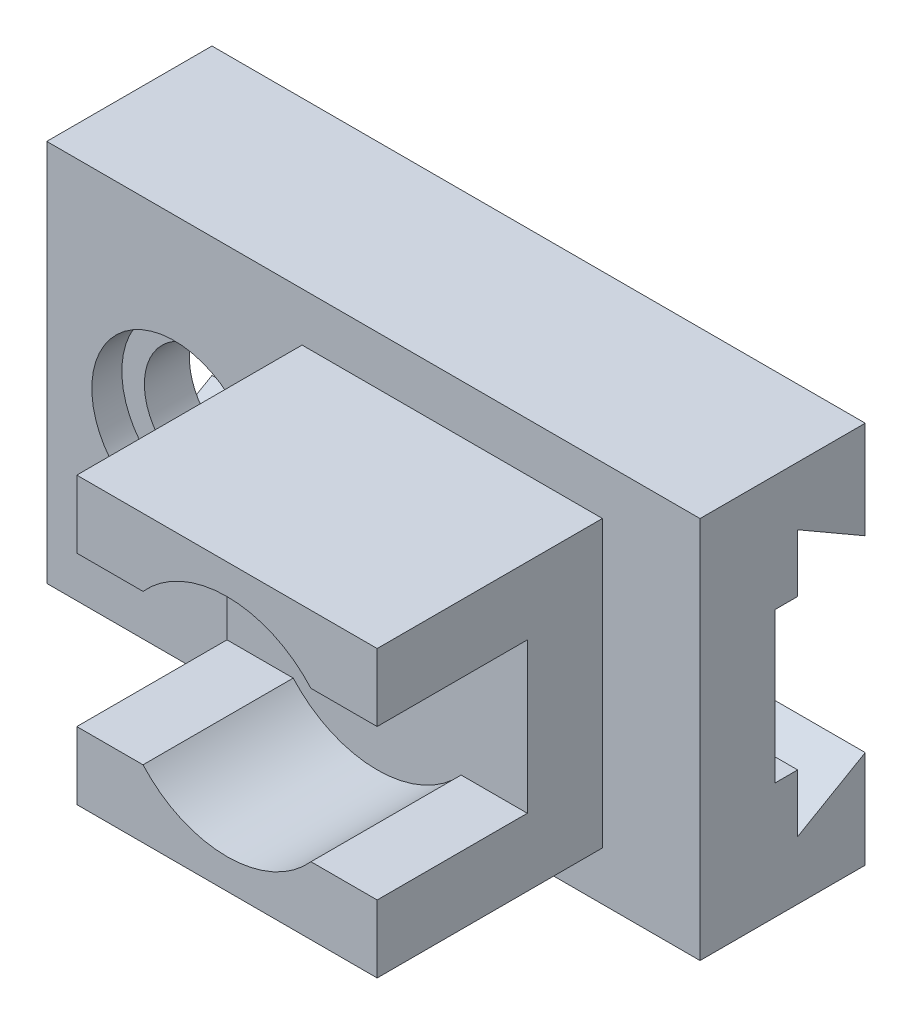
ISO-10303-21;
HEADER;
FILE_DESCRIPTION(('STEP AP214'),'2;1');
FILE_NAME('part.step','',(''),(''),'','','');
FILE_SCHEMA(('AUTOMOTIVE_DESIGN { 1 0 10303 214 1 1 1 1 }'));
ENDSEC;
DATA;
#1=APPLICATION_CONTEXT('core data for automotive mechanical design processes');
#2=APPLICATION_PROTOCOL_DEFINITION('international standard','automotive_design',2000,#1);
#3=PRODUCT_CONTEXT('',#1,'mechanical');
#4=PRODUCT('Part','Part','',(#3));
#5=PRODUCT_RELATED_PRODUCT_CATEGORY('part','',(#4));
#6=PRODUCT_DEFINITION_FORMATION('','',#4);
#7=PRODUCT_DEFINITION_CONTEXT('part definition',#1,'design');
#8=PRODUCT_DEFINITION('design','',#6,#7);
#9=PRODUCT_DEFINITION_SHAPE('','',#8);
#10=(LENGTH_UNIT() NAMED_UNIT(*) SI_UNIT(.MILLI.,.METRE.));
#11=(NAMED_UNIT(*) PLANE_ANGLE_UNIT() SI_UNIT($,.RADIAN.));
#12=(NAMED_UNIT(*) SI_UNIT($,.STERADIAN.) SOLID_ANGLE_UNIT());
#13=UNCERTAINTY_MEASURE_WITH_UNIT(LENGTH_MEASURE(1.E-05),#10,'distance_accuracy_value','');
#14=(GEOMETRIC_REPRESENTATION_CONTEXT(3) GLOBAL_UNCERTAINTY_ASSIGNED_CONTEXT((#13)) GLOBAL_UNIT_ASSIGNED_CONTEXT((#10,
#11,#12)) REPRESENTATION_CONTEXT('',''));
#15=CARTESIAN_POINT('',(0.,0.,0.));
#16=DIRECTION('',(0.,0.,1.));
#17=DIRECTION('',(1.,0.,0.));
#18=AXIS2_PLACEMENT_3D('',#15,#16,#17);
#19=CARTESIAN_POINT('',(0.,0.,-22.));
#20=DIRECTION('',(0.,0.,1.));
#21=DIRECTION('',(1.,0.,0.));
#22=AXIS2_PLACEMENT_3D('',#19,#20,#21);
#23=PLANE('',#22);
#24=DIRECTION('',(0.,-1.,0.));
#25=VECTOR('',#24,1.);
#26=CARTESIAN_POINT('',(-43.5,25.491,-22.));
#27=LINE('',#26,#25);
#28=CARTESIAN_POINT('',(-43.5,-12.5,-22.));
#29=VERTEX_POINT('',#28);
#30=CARTESIAN_POINT('',(-43.5,-25.491,-22.));
#31=VERTEX_POINT('',#30);
#32=EDGE_CURVE('E393',#29,#31,#27,.T.);
#33=ORIENTED_EDGE('',*,*,#32,.F.);
#34=DIRECTION('',(-1.,0.,0.));
#35=VECTOR('',#34,1.);
#36=CARTESIAN_POINT('',(43.5,-12.5,-22.));
#37=LINE('',#36,#35);
#38=CARTESIAN_POINT('',(43.5,-12.5,-22.));
#39=VERTEX_POINT('',#38);
#40=EDGE_CURVE('E294',#39,#29,#37,.T.);
#41=ORIENTED_EDGE('',*,*,#40,.F.);
#42=DIRECTION('',(0.,1.,0.));
#43=VECTOR('',#42,1.);
#44=CARTESIAN_POINT('',(43.5,-25.491,-22.));
#45=LINE('',#44,#43);
#46=CARTESIAN_POINT('',(43.5,-25.491,-22.));
#47=VERTEX_POINT('',#46);
#48=EDGE_CURVE('E402',#47,#39,#45,.T.);
#49=ORIENTED_EDGE('',*,*,#48,.F.);
#50=DIRECTION('',(1.,0.,0.));
#51=VECTOR('',#50,1.);
#52=CARTESIAN_POINT('',(-43.5,-25.491,-22.));
#53=LINE('',#52,#51);
#54=EDGE_CURVE('E398',#31,#47,#53,.T.);
#55=ORIENTED_EDGE('',*,*,#54,.F.);
#56=EDGE_LOOP('',(#33,#41,#49,#55));
#57=FACE_BOUND('',#56,.T.);
#58=ADVANCED_FACE('F71',(#57),#23,.F.);
#59=CARTESIAN_POINT('',(30.5,-19.,30.));
#60=DIRECTION('',(-1.,0.,0.));
#61=DIRECTION('',(0.,0.,1.));
#62=AXIS2_PLACEMENT_3D('',#59,#60,#61);
#63=PLANE('',#62);
#64=DIRECTION('',(0.,0.,1.));
#65=VECTOR('',#64,1.);
#66=CARTESIAN_POINT('',(30.5,9.99999999999999,10.));
#67=LINE('',#66,#65);
#68=CARTESIAN_POINT('',(30.5,9.99999999999999,10.));
#69=VERTEX_POINT('',#68);
#70=CARTESIAN_POINT('',(30.5,9.99999999999999,30.));
#71=VERTEX_POINT('',#70);
#72=EDGE_CURVE('E316',#69,#71,#67,.T.);
#73=ORIENTED_EDGE('',*,*,#72,.F.);
#74=DIRECTION('',(0.,1.,0.));
#75=VECTOR('',#74,1.);
#76=CARTESIAN_POINT('',(30.5,-9.99999999999999,10.));
#77=LINE('',#76,#75);
#78=CARTESIAN_POINT('',(30.5,-9.99999999999999,10.));
#79=VERTEX_POINT('',#78);
#80=EDGE_CURVE('E322',#79,#69,#77,.T.);
#81=ORIENTED_EDGE('',*,*,#80,.F.);
#82=DIRECTION('',(0.,0.,1.));
#83=VECTOR('',#82,1.);
#84=CARTESIAN_POINT('',(30.5,-9.99999999999999,10.));
#85=LINE('',#84,#83);
#86=CARTESIAN_POINT('',(30.5,-9.99999999999999,30.));
#87=VERTEX_POINT('',#86);
#88=EDGE_CURVE('E346',#79,#87,#85,.T.);
#89=ORIENTED_EDGE('',*,*,#88,.T.);
#90=DIRECTION('',(0.,1.,0.));
#91=VECTOR('',#90,1.);
#92=CARTESIAN_POINT('',(30.5,-19.,30.));
#93=LINE('',#92,#91);
#94=CARTESIAN_POINT('',(30.5,-19.,30.));
#95=VERTEX_POINT('',#94);
#96=EDGE_CURVE('E361',#95,#87,#93,.T.);
#97=ORIENTED_EDGE('',*,*,#96,.F.);
#98=DIRECTION('',(0.,0.,-1.));
#99=VECTOR('',#98,1.);
#100=CARTESIAN_POINT('',(30.5,-19.,30.));
#101=LINE('',#100,#99);
#102=CARTESIAN_POINT('',(30.5,-19.,0.));
#103=VERTEX_POINT('',#102);
#104=EDGE_CURVE('E375',#95,#103,#101,.T.);
#105=ORIENTED_EDGE('',*,*,#104,.T.);
#106=DIRECTION('',(0.,1.,0.));
#107=VECTOR('',#106,1.);
#108=CARTESIAN_POINT('',(30.5,-19.,0.));
#109=LINE('',#108,#107);
#110=CARTESIAN_POINT('',(30.5,19.,0.));
#111=VERTEX_POINT('',#110);
#112=EDGE_CURVE('E354',#103,#111,#109,.T.);
#113=ORIENTED_EDGE('',*,*,#112,.T.);
#114=DIRECTION('',(0.,0.,-1.));
#115=VECTOR('',#114,1.);
#116=CARTESIAN_POINT('',(30.5,19.,30.));
#117=LINE('',#116,#115);
#118=CARTESIAN_POINT('',(30.5,19.,30.));
#119=VERTEX_POINT('',#118);
#120=EDGE_CURVE('E364',#119,#111,#117,.T.);
#121=ORIENTED_EDGE('',*,*,#120,.F.);
#122=EDGE_CURVE('E360',#71,#119,#93,.T.);
#123=ORIENTED_EDGE('',*,*,#122,.F.);
#124=EDGE_LOOP('',(#73,#81,#89,#97,#105,#113,#121,#123));
#125=FACE_BOUND('',#124,.T.);
#126=ADVANCED_FACE('F483',(#125),#63,.F.);
#127=CARTESIAN_POINT('',(0.,0.,30.));
#128=DIRECTION('',(0.,0.,1.));
#129=DIRECTION('',(1.,0.,0.));
#130=AXIS2_PLACEMENT_3D('',#127,#128,#129);
#131=PLANE('',#130);
#132=CARTESIAN_POINT('',(10.5,0.,30.));
#133=DIRECTION('',(0.,0.,1.));
#134=DIRECTION('',(1.,0.,0.));
#135=AXIS2_PLACEMENT_3D('',#132,#133,#134);
#136=CIRCLE('',#135,15.);
#137=CARTESIAN_POINT('',(21.680339887499,9.99999999999999,30.));
#138=VERTEX_POINT('',#137);
#139=CARTESIAN_POINT('',(-0.680339887498955,9.99999999999999,30.));
#140=VERTEX_POINT('',#139);
#141=EDGE_CURVE('E96',#138,#140,#136,.T.);
#142=ORIENTED_EDGE('',*,*,#141,.F.);
#143=DIRECTION('',(1.,0.,0.));
#144=VECTOR('',#143,1.);
#145=CARTESIAN_POINT('',(-9.5,9.99999999999999,30.));
#146=LINE('',#145,#144);
#147=EDGE_CURVE('E338',#138,#71,#146,.T.);
#148=ORIENTED_EDGE('',*,*,#147,.T.);
#149=ORIENTED_EDGE('',*,*,#122,.T.);
#150=DIRECTION('',(-1.,0.,0.));
#151=VECTOR('',#150,1.);
#152=CARTESIAN_POINT('',(30.5,19.,30.));
#153=LINE('',#152,#151);
#154=CARTESIAN_POINT('',(-9.5,19.,30.));
#155=VERTEX_POINT('',#154);
#156=EDGE_CURVE('E350',#119,#155,#153,.T.);
#157=ORIENTED_EDGE('',*,*,#156,.T.);
#158=DIRECTION('',(0.,-1.,0.));
#159=VECTOR('',#158,1.);
#160=CARTESIAN_POINT('',(-9.5,19.,30.));
#161=LINE('',#160,#159);
#162=CARTESIAN_POINT('',(-9.5,9.99999999999999,30.));
#163=VERTEX_POINT('',#162);
#164=EDGE_CURVE('E355',#155,#163,#161,.T.);
#165=ORIENTED_EDGE('',*,*,#164,.T.);
#166=EDGE_CURVE('E334',#163,#140,#146,.T.);
#167=ORIENTED_EDGE('',*,*,#166,.T.);
#168=EDGE_LOOP('',(#142,#148,#149,#157,#165,#167));
#169=FACE_BOUND('',#168,.T.);
#170=ADVANCED_FACE('F440',(#169),#131,.T.);
#171=CARTESIAN_POINT('',(0.,0.,0.));
#172=DIRECTION('',(0.,0.,1.));
#173=DIRECTION('',(1.,0.,0.));
#174=AXIS2_PLACEMENT_3D('',#171,#172,#173);
#175=PLANE('',#174);
#176=CARTESIAN_POINT('',(-26.5,0.,0.));
#177=DIRECTION('',(0.,0.,1.));
#178=DIRECTION('',(1.,0.,0.));
#179=AXIS2_PLACEMENT_3D('',#176,#177,#178);
#180=CIRCLE('',#179,11.);
#181=CARTESIAN_POINT('',(-15.5,0.,0.));
#182=VERTEX_POINT('',#181);
#183=EDGE_CURVE('E387',#182,#182,#180,.T.);
#184=ORIENTED_EDGE('',*,*,#183,.F.);
#185=EDGE_LOOP('',(#184));
#186=FACE_BOUND('',#185,.T.);
#187=DIRECTION('',(-1.,0.,0.));
#188=VECTOR('',#187,1.);
#189=CARTESIAN_POINT('',(43.5,25.491,0.));
#190=LINE('',#189,#188);
#191=CARTESIAN_POINT('',(43.5,25.491,0.));
#192=VERTEX_POINT('',#191);
#193=CARTESIAN_POINT('',(-43.5,25.491,0.));
#194=VERTEX_POINT('',#193);
#195=EDGE_CURVE('E386',#192,#194,#190,.T.);
#196=ORIENTED_EDGE('',*,*,#195,.T.);
#197=DIRECTION('',(0.,-1.,0.));
#198=VECTOR('',#197,1.);
#199=CARTESIAN_POINT('',(-43.5,25.491,0.));
#200=LINE('',#199,#198);
#201=CARTESIAN_POINT('',(-43.5,-25.491,0.));
#202=VERTEX_POINT('',#201);
#203=EDGE_CURVE('E408',#194,#202,#200,.T.);
#204=ORIENTED_EDGE('',*,*,#203,.T.);
#205=DIRECTION('',(1.,0.,0.));
#206=VECTOR('',#205,1.);
#207=CARTESIAN_POINT('',(-43.5,-25.491,0.));
#208=LINE('',#207,#206);
#209=CARTESIAN_POINT('',(43.5,-25.491,0.));
#210=VERTEX_POINT('',#209);
#211=EDGE_CURVE('E411',#202,#210,#208,.T.);
#212=ORIENTED_EDGE('',*,*,#211,.T.);
#213=DIRECTION('',(0.,1.,0.));
#214=VECTOR('',#213,1.);
#215=CARTESIAN_POINT('',(43.5,-25.491,0.));
#216=LINE('',#215,#214);
#217=EDGE_CURVE('E394',#210,#192,#216,.T.);
#218=ORIENTED_EDGE('',*,*,#217,.T.);
#219=EDGE_LOOP('',(#196,#204,#212,#218));
#220=FACE_BOUND('',#219,.T.);
#221=DIRECTION('',(0.,-1.,0.));
#222=VECTOR('',#221,1.);
#223=CARTESIAN_POINT('',(-9.5,19.,0.));
#224=LINE('',#223,#222);
#225=CARTESIAN_POINT('',(-9.5,19.,0.));
#226=VERTEX_POINT('',#225);
#227=CARTESIAN_POINT('',(-9.5,-19.,0.));
#228=VERTEX_POINT('',#227);
#229=EDGE_CURVE('E367',#226,#228,#224,.T.);
#230=ORIENTED_EDGE('',*,*,#229,.F.);
#231=DIRECTION('',(-1.,0.,0.));
#232=VECTOR('',#231,1.);
#233=CARTESIAN_POINT('',(30.5,19.,0.));
#234=LINE('',#233,#232);
#235=EDGE_CURVE('E307',#111,#226,#234,.T.);
#236=ORIENTED_EDGE('',*,*,#235,.F.);
#237=ORIENTED_EDGE('',*,*,#112,.F.);
#238=DIRECTION('',(1.,0.,0.));
#239=VECTOR('',#238,1.);
#240=CARTESIAN_POINT('',(-9.5,-19.,0.));
#241=LINE('',#240,#239);
#242=EDGE_CURVE('E369',#228,#103,#241,.T.);
#243=ORIENTED_EDGE('',*,*,#242,.F.);
#244=EDGE_LOOP('',(#230,#236,#237,#243));
#245=FACE_BOUND('',#244,.T.);
#246=ADVANCED_FACE('F437',(#186,#220,#245),#175,.T.);
#247=CARTESIAN_POINT('',(43.5,25.491,-22.));
#248=DIRECTION('',(0.,1.,0.));
#249=DIRECTION('',(-1.,0.,0.));
#250=AXIS2_PLACEMENT_3D('',#247,#248,#249);
#251=PLANE('',#250);
#252=ORIENTED_EDGE('',*,*,#195,.F.);
#253=DIRECTION('',(0.,0.,1.));
#254=VECTOR('',#253,1.);
#255=CARTESIAN_POINT('',(43.5,25.491,-22.));
#256=LINE('',#255,#254);
#257=CARTESIAN_POINT('',(43.5,25.491,-22.));
#258=VERTEX_POINT('',#257);
#259=EDGE_CURVE('E12',#258,#192,#256,.T.);
#260=ORIENTED_EDGE('',*,*,#259,.F.);
#261=DIRECTION('',(-1.,0.,0.));
#262=VECTOR('',#261,1.);
#263=CARTESIAN_POINT('',(43.5,25.491,-22.));
#264=LINE('',#263,#262);
#265=CARTESIAN_POINT('',(-43.5,25.491,-22.));
#266=VERTEX_POINT('',#265);
#267=EDGE_CURVE('E390',#258,#266,#264,.T.);
#268=ORIENTED_EDGE('',*,*,#267,.T.);
#269=DIRECTION('',(0.,0.,1.));
#270=VECTOR('',#269,1.);
#271=CARTESIAN_POINT('',(-43.5,25.491,-22.));
#272=LINE('',#271,#270);
#273=EDGE_CURVE('E405',#266,#194,#272,.T.);
#274=ORIENTED_EDGE('',*,*,#273,.T.);
#275=EDGE_LOOP('',(#252,#260,#268,#274));
#276=FACE_BOUND('',#275,.T.);
#277=ADVANCED_FACE('F73',(#276),#251,.T.);
#278=CARTESIAN_POINT('',(43.5,-25.491,-22.));
#279=DIRECTION('',(1.,0.,0.));
#280=DIRECTION('',(0.,1.,0.));
#281=AXIS2_PLACEMENT_3D('',#278,#279,#280);
#282=PLANE('',#281);
#283=DIRECTION('',(0.,-0.500000000000002,0.866025403784438));
#284=VECTOR('',#283,1.);
#285=CARTESIAN_POINT('',(43.5,-17.6961524227067,-13.));
#286=LINE('',#285,#284);
#287=CARTESIAN_POINT('',(43.5,-17.6961524227067,-13.));
#288=VERTEX_POINT('',#287);
#289=EDGE_CURVE('E266',#39,#288,#286,.T.);
#290=ORIENTED_EDGE('',*,*,#289,.T.);
#291=DIRECTION('',(0.,1.,0.));
#292=VECTOR('',#291,1.);
#293=CARTESIAN_POINT('',(43.5,-10.,-13.));
#294=LINE('',#293,#292);
#295=CARTESIAN_POINT('',(43.5,-10.,-13.));
#296=VERTEX_POINT('',#295);
#297=EDGE_CURVE('E268',#288,#296,#294,.T.);
#298=ORIENTED_EDGE('',*,*,#297,.T.);
#299=DIRECTION('',(0.,0.,1.));
#300=VECTOR('',#299,1.);
#301=CARTESIAN_POINT('',(43.5,-10.,-10.));
#302=LINE('',#301,#300);
#303=CARTESIAN_POINT('',(43.5,-10.,-10.));
#304=VERTEX_POINT('',#303);
#305=EDGE_CURVE('E271',#296,#304,#302,.T.);
#306=ORIENTED_EDGE('',*,*,#305,.T.);
#307=DIRECTION('',(0.,1.,0.));
#308=VECTOR('',#307,1.);
#309=CARTESIAN_POINT('',(43.5,10.,-10.));
#310=LINE('',#309,#308);
#311=CARTESIAN_POINT('',(43.5,10.,-10.));
#312=VERTEX_POINT('',#311);
#313=EDGE_CURVE('E245',#304,#312,#310,.T.);
#314=ORIENTED_EDGE('',*,*,#313,.T.);
#315=DIRECTION('',(0.,0.,-1.));
#316=VECTOR('',#315,1.);
#317=CARTESIAN_POINT('',(43.5,10.,-10.));
#318=LINE('',#317,#316);
#319=CARTESIAN_POINT('',(43.5,10.,-13.));
#320=VERTEX_POINT('',#319);
#321=EDGE_CURVE('E237',#312,#320,#318,.T.);
#322=ORIENTED_EDGE('',*,*,#321,.T.);
#323=DIRECTION('',(0.,1.,0.));
#324=VECTOR('',#323,1.);
#325=CARTESIAN_POINT('',(43.5,10.,-13.));
#326=LINE('',#325,#324);
#327=CARTESIAN_POINT('',(43.5,17.6961524227067,-13.));
#328=VERTEX_POINT('',#327);
#329=EDGE_CURVE('E248',#320,#328,#326,.T.);
#330=ORIENTED_EDGE('',*,*,#329,.T.);
#331=DIRECTION('',(0.,-0.500000000000002,-0.866025403784438));
#332=VECTOR('',#331,1.);
#333=CARTESIAN_POINT('',(43.5,17.6961524227067,-13.));
#334=LINE('',#333,#332);
#335=CARTESIAN_POINT('',(43.5,12.5,-22.));
#336=VERTEX_POINT('',#335);
#337=EDGE_CURVE('E253',#328,#336,#334,.T.);
#338=ORIENTED_EDGE('',*,*,#337,.T.);
#339=EDGE_CURVE('E401',#336,#258,#45,.T.);
#340=ORIENTED_EDGE('',*,*,#339,.T.);
#341=ORIENTED_EDGE('',*,*,#259,.T.);
#342=ORIENTED_EDGE('',*,*,#217,.F.);
#343=DIRECTION('',(0.,0.,1.));
#344=VECTOR('',#343,1.);
#345=CARTESIAN_POINT('',(43.5,-25.491,-22.));
#346=LINE('',#345,#344);
#347=EDGE_CURVE('E80',#47,#210,#346,.T.);
#348=ORIENTED_EDGE('',*,*,#347,.F.);
#349=ORIENTED_EDGE('',*,*,#48,.T.);
#350=EDGE_LOOP('',(#290,#298,#306,#314,#322,#330,#338,#340,#341,#342,#348,#349));
#351=FACE_BOUND('',#350,.T.);
#352=ADVANCED_FACE('F256',(#351),#282,.T.);
#353=CARTESIAN_POINT('',(-43.5,-25.491,-22.));
#354=DIRECTION('',(0.,-1.,0.));
#355=DIRECTION('',(1.,0.,0.));
#356=AXIS2_PLACEMENT_3D('',#353,#354,#355);
#357=PLANE('',#356);
#358=ORIENTED_EDGE('',*,*,#211,.F.);
#359=DIRECTION('',(0.,0.,1.));
#360=VECTOR('',#359,1.);
#361=CARTESIAN_POINT('',(-43.5,-25.491,-22.));
#362=LINE('',#361,#360);
#363=EDGE_CURVE('E417',#31,#202,#362,.T.);
#364=ORIENTED_EDGE('',*,*,#363,.F.);
#365=ORIENTED_EDGE('',*,*,#54,.T.);
#366=ORIENTED_EDGE('',*,*,#347,.T.);
#367=EDGE_LOOP('',(#358,#364,#365,#366));
#368=FACE_BOUND('',#367,.T.);
#369=ADVANCED_FACE('F524',(#368),#357,.T.);
#370=CARTESIAN_POINT('',(-43.5,25.491,-22.));
#371=DIRECTION('',(-1.,0.,0.));
#372=DIRECTION('',(0.,0.,1.));
#373=AXIS2_PLACEMENT_3D('',#370,#371,#372);
#374=PLANE('',#373);
#375=DIRECTION('',(0.,-0.500000000000002,0.866025403784438));
#376=VECTOR('',#375,1.);
#377=CARTESIAN_POINT('',(-43.5,-17.6961524227067,-13.));
#378=LINE('',#377,#376);
#379=CARTESIAN_POINT('',(-43.5,-17.6961524227067,-13.));
#380=VERTEX_POINT('',#379);
#381=EDGE_CURVE('E278',#29,#380,#378,.T.);
#382=ORIENTED_EDGE('',*,*,#381,.F.);
#383=ORIENTED_EDGE('',*,*,#32,.T.);
#384=ORIENTED_EDGE('',*,*,#363,.T.);
#385=ORIENTED_EDGE('',*,*,#203,.F.);
#386=ORIENTED_EDGE('',*,*,#273,.F.);
#387=CARTESIAN_POINT('',(-43.5,12.5,-22.));
#388=VERTEX_POINT('',#387);
#389=EDGE_CURVE('E395',#266,#388,#27,.T.);
#390=ORIENTED_EDGE('',*,*,#389,.T.);
#391=DIRECTION('',(0.,-0.500000000000002,-0.866025403784438));
#392=VECTOR('',#391,1.);
#393=CARTESIAN_POINT('',(-43.5,17.6961524227067,-13.));
#394=LINE('',#393,#392);
#395=CARTESIAN_POINT('',(-43.5,17.6961524227067,-13.));
#396=VERTEX_POINT('',#395);
#397=EDGE_CURVE('E88',#396,#388,#394,.T.);
#398=ORIENTED_EDGE('',*,*,#397,.F.);
#399=DIRECTION('',(0.,1.,0.));
#400=VECTOR('',#399,1.);
#401=CARTESIAN_POINT('',(-43.5,10.,-13.));
#402=LINE('',#401,#400);
#403=CARTESIAN_POINT('',(-43.5,10.,-13.));
#404=VERTEX_POINT('',#403);
#405=EDGE_CURVE('E275',#404,#396,#402,.T.);
#406=ORIENTED_EDGE('',*,*,#405,.F.);
#407=DIRECTION('',(0.,0.,-1.));
#408=VECTOR('',#407,1.);
#409=CARTESIAN_POINT('',(-43.5,10.,-10.));
#410=LINE('',#409,#408);
#411=CARTESIAN_POINT('',(-43.5,10.,-10.));
#412=VERTEX_POINT('',#411);
#413=EDGE_CURVE('E240',#412,#404,#410,.T.);
#414=ORIENTED_EDGE('',*,*,#413,.F.);
#415=DIRECTION('',(0.,1.,0.));
#416=VECTOR('',#415,1.);
#417=CARTESIAN_POINT('',(-43.5,10.,-10.));
#418=LINE('',#417,#416);
#419=CARTESIAN_POINT('',(-43.5,-10.,-10.));
#420=VERTEX_POINT('',#419);
#421=EDGE_CURVE('E259',#420,#412,#418,.T.);
#422=ORIENTED_EDGE('',*,*,#421,.F.);
#423=DIRECTION('',(0.,0.,1.));
#424=VECTOR('',#423,1.);
#425=CARTESIAN_POINT('',(-43.5,-10.,-10.));
#426=LINE('',#425,#424);
#427=CARTESIAN_POINT('',(-43.5,-10.,-13.));
#428=VERTEX_POINT('',#427);
#429=EDGE_CURVE('E262',#428,#420,#426,.T.);
#430=ORIENTED_EDGE('',*,*,#429,.F.);
#431=DIRECTION('',(0.,1.,0.));
#432=VECTOR('',#431,1.);
#433=CARTESIAN_POINT('',(-43.5,-10.,-13.));
#434=LINE('',#433,#432);
#435=EDGE_CURVE('E281',#380,#428,#434,.T.);
#436=ORIENTED_EDGE('',*,*,#435,.F.);
#437=EDGE_LOOP('',(#382,#383,#384,#385,#386,#390,#398,#406,#414,#422,#430,#436));
#438=FACE_BOUND('',#437,.T.);
#439=ADVANCED_FACE('F519',(#438),#374,.T.);
#440=ORIENTED_EDGE('',*,*,#339,.F.);
#441=DIRECTION('',(-1.,0.,0.));
#442=VECTOR('',#441,1.);
#443=CARTESIAN_POINT('',(43.5,12.5,-22.));
#444=LINE('',#443,#442);
#445=EDGE_CURVE('E296',#336,#388,#444,.T.);
#446=ORIENTED_EDGE('',*,*,#445,.T.);
#447=ORIENTED_EDGE('',*,*,#389,.F.);
#448=ORIENTED_EDGE('',*,*,#267,.F.);
#449=EDGE_LOOP('',(#440,#446,#447,#448));
#450=FACE_BOUND('',#449,.T.);
#451=ADVANCED_FACE('F433',(#450),#23,.F.);
#452=CARTESIAN_POINT('',(-26.5,0.,-4.));
#453=DIRECTION('',(0.,0.,1.));
#454=DIRECTION('',(1.,0.,0.));
#455=AXIS2_PLACEMENT_3D('',#452,#453,#454);
#456=CYLINDRICAL_SURFACE('',#455,11.);
#457=CARTESIAN_POINT('',(-26.5,0.,-4.));
#458=DIRECTION('',(0.,0.,1.));
#459=DIRECTION('',(1.,0.,0.));
#460=AXIS2_PLACEMENT_3D('',#457,#458,#459);
#461=CIRCLE('',#460,11.);
#462=CARTESIAN_POINT('',(-15.5,0.,-4.));
#463=VERTEX_POINT('',#462);
#464=EDGE_CURVE('E383',#463,#463,#461,.T.);
#465=ORIENTED_EDGE('',*,*,#464,.F.);
#466=EDGE_LOOP('',(#465));
#467=FACE_BOUND('',#466,.T.);
#468=ORIENTED_EDGE('',*,*,#183,.T.);
#469=EDGE_LOOP('',(#468));
#470=FACE_BOUND('',#469,.T.);
#471=ADVANCED_FACE('F427',(#467,#470),#456,.F.);
#472=CARTESIAN_POINT('',(-26.5,0.,-4.));
#473=DIRECTION('',(0.,0.,1.));
#474=DIRECTION('',(1.,0.,0.));
#475=AXIS2_PLACEMENT_3D('',#472,#473,#474);
#476=PLANE('',#475);
#477=CARTESIAN_POINT('',(-26.5,0.,-4.));
#478=DIRECTION('',(0.,0.,1.));
#479=DIRECTION('',(1.,0.,0.));
#480=AXIS2_PLACEMENT_3D('',#477,#478,#479);
#481=CIRCLE('',#480,8.);
#482=CARTESIAN_POINT('',(-18.5,0.,-4.));
#483=VERTEX_POINT('',#482);
#484=EDGE_CURVE('E382',#483,#483,#481,.T.);
#485=ORIENTED_EDGE('',*,*,#484,.F.);
#486=EDGE_LOOP('',(#485));
#487=FACE_BOUND('',#486,.T.);
#488=ORIENTED_EDGE('',*,*,#464,.T.);
#489=EDGE_LOOP('',(#488));
#490=FACE_BOUND('',#489,.T.);
#491=ADVANCED_FACE('F424',(#487,#490),#476,.T.);
#492=CARTESIAN_POINT('',(-26.5,0.,-22.));
#493=DIRECTION('',(0.,0.,1.));
#494=DIRECTION('',(1.,0.,0.));
#495=AXIS2_PLACEMENT_3D('',#492,#493,#494);
#496=CYLINDRICAL_SURFACE('',#495,8.);
#497=CARTESIAN_POINT('',(-26.5,0.,-10.));
#498=DIRECTION('',(0.,0.,1.));
#499=DIRECTION('',(1.,0.,0.));
#500=AXIS2_PLACEMENT_3D('',#497,#498,#499);
#501=CIRCLE('',#500,8.);
#502=CARTESIAN_POINT('',(-18.5,0.,-10.));
#503=VERTEX_POINT('',#502);
#504=EDGE_CURVE('E75',#503,#503,#501,.F.);
#505=ORIENTED_EDGE('',*,*,#504,.T.);
#506=EDGE_LOOP('',(#505));
#507=FACE_BOUND('',#506,.T.);
#508=ORIENTED_EDGE('',*,*,#484,.T.);
#509=EDGE_LOOP('',(#508));
#510=FACE_BOUND('',#509,.T.);
#511=ADVANCED_FACE('F422',(#507,#510),#496,.F.);
#512=CARTESIAN_POINT('',(30.5,19.,30.));
#513=DIRECTION('',(0.,-1.,0.));
#514=DIRECTION('',(0.,0.,-1.));
#515=AXIS2_PLACEMENT_3D('',#512,#513,#514);
#516=PLANE('',#515);
#517=ORIENTED_EDGE('',*,*,#235,.T.);
#518=DIRECTION('',(0.,0.,-1.));
#519=VECTOR('',#518,1.);
#520=CARTESIAN_POINT('',(-9.5,19.,30.));
#521=LINE('',#520,#519);
#522=EDGE_CURVE('E380',#155,#226,#521,.T.);
#523=ORIENTED_EDGE('',*,*,#522,.F.);
#524=ORIENTED_EDGE('',*,*,#156,.F.);
#525=ORIENTED_EDGE('',*,*,#120,.T.);
#526=EDGE_LOOP('',(#517,#523,#524,#525));
#527=FACE_BOUND('',#526,.T.);
#528=ADVANCED_FACE('F576',(#527),#516,.F.);
#529=CARTESIAN_POINT('',(-9.5,19.,30.));
#530=DIRECTION('',(1.,0.,0.));
#531=DIRECTION('',(0.,0.,-1.));
#532=AXIS2_PLACEMENT_3D('',#529,#530,#531);
#533=PLANE('',#532);
#534=CARTESIAN_POINT('',(-9.5,-10.,30.));
#535=VERTEX_POINT('',#534);
#536=CARTESIAN_POINT('',(-9.5,-19.,30.));
#537=VERTEX_POINT('',#536);
#538=EDGE_CURVE('E353',#535,#537,#161,.T.);
#539=ORIENTED_EDGE('',*,*,#538,.F.);
#540=DIRECTION('',(0.,0.,1.));
#541=VECTOR('',#540,1.);
#542=CARTESIAN_POINT('',(-9.5,-10.,10.));
#543=LINE('',#542,#541);
#544=CARTESIAN_POINT('',(-9.5,-10.,10.));
#545=VERTEX_POINT('',#544);
#546=EDGE_CURVE('E344',#545,#535,#543,.T.);
#547=ORIENTED_EDGE('',*,*,#546,.F.);
#548=DIRECTION('',(0.,1.,0.));
#549=VECTOR('',#548,1.);
#550=CARTESIAN_POINT('',(-9.5,-10.,10.));
#551=LINE('',#550,#549);
#552=CARTESIAN_POINT('',(-9.5,9.99999999999999,10.));
#553=VERTEX_POINT('',#552);
#554=EDGE_CURVE('E330',#545,#553,#551,.T.);
#555=ORIENTED_EDGE('',*,*,#554,.T.);
#556=DIRECTION('',(0.,0.,1.));
#557=VECTOR('',#556,1.);
#558=CARTESIAN_POINT('',(-9.5,9.99999999999999,10.));
#559=LINE('',#558,#557);
#560=EDGE_CURVE('E333',#553,#163,#559,.T.);
#561=ORIENTED_EDGE('',*,*,#560,.T.);
#562=ORIENTED_EDGE('',*,*,#164,.F.);
#563=ORIENTED_EDGE('',*,*,#522,.T.);
#564=ORIENTED_EDGE('',*,*,#229,.T.);
#565=DIRECTION('',(0.,0.,-1.));
#566=VECTOR('',#565,1.);
#567=CARTESIAN_POINT('',(-9.5,-19.,30.));
#568=LINE('',#567,#566);
#569=EDGE_CURVE('E377',#537,#228,#568,.T.);
#570=ORIENTED_EDGE('',*,*,#569,.F.);
#571=EDGE_LOOP('',(#539,#547,#555,#561,#562,#563,#564,#570));
#572=FACE_BOUND('',#571,.T.);
#573=ADVANCED_FACE('F451',(#572),#533,.F.);
#574=CARTESIAN_POINT('',(-9.5,-19.,30.));
#575=DIRECTION('',(0.,1.,0.));
#576=DIRECTION('',(0.,0.,1.));
#577=AXIS2_PLACEMENT_3D('',#574,#575,#576);
#578=PLANE('',#577);
#579=ORIENTED_EDGE('',*,*,#242,.T.);
#580=ORIENTED_EDGE('',*,*,#104,.F.);
#581=DIRECTION('',(1.,0.,0.));
#582=VECTOR('',#581,1.);
#583=CARTESIAN_POINT('',(-9.5,-19.,30.));
#584=LINE('',#583,#582);
#585=EDGE_CURVE('E358',#537,#95,#584,.T.);
#586=ORIENTED_EDGE('',*,*,#585,.F.);
#587=ORIENTED_EDGE('',*,*,#569,.T.);
#588=EDGE_LOOP('',(#579,#580,#586,#587));
#589=FACE_BOUND('',#588,.T.);
#590=ADVANCED_FACE('F455',(#589),#578,.F.);
#591=DIRECTION('',(1.,0.,0.));
#592=VECTOR('',#591,1.);
#593=CARTESIAN_POINT('',(-9.5,-10.,30.));
#594=LINE('',#593,#592);
#595=CARTESIAN_POINT('',(21.680339887499,-10.,30.));
#596=VERTEX_POINT('',#595);
#597=EDGE_CURVE('E337',#596,#87,#594,.T.);
#598=ORIENTED_EDGE('',*,*,#597,.F.);
#599=CARTESIAN_POINT('',(10.5,0.,30.));
#600=DIRECTION('',(0.,0.,1.));
#601=DIRECTION('',(1.,0.,0.));
#602=AXIS2_PLACEMENT_3D('',#599,#600,#601);
#603=CIRCLE('',#602,15.);
#604=CARTESIAN_POINT('',(-0.680339887498943,-10.,30.));
#605=VERTEX_POINT('',#604);
#606=EDGE_CURVE('E313',#605,#596,#603,.T.);
#607=ORIENTED_EDGE('',*,*,#606,.F.);
#608=EDGE_CURVE('E339',#535,#605,#594,.T.);
#609=ORIENTED_EDGE('',*,*,#608,.F.);
#610=ORIENTED_EDGE('',*,*,#538,.T.);
#611=ORIENTED_EDGE('',*,*,#585,.T.);
#612=ORIENTED_EDGE('',*,*,#96,.T.);
#613=EDGE_LOOP('',(#598,#607,#609,#610,#611,#612));
#614=FACE_BOUND('',#613,.T.);
#615=ADVANCED_FACE('F460',(#614),#131,.T.);
#616=CARTESIAN_POINT('',(10.5,0.,10.));
#617=DIRECTION('',(0.,0.,1.));
#618=DIRECTION('',(1.,0.,0.));
#619=AXIS2_PLACEMENT_3D('',#616,#617,#618);
#620=CYLINDRICAL_SURFACE('',#619,15.);
#621=ORIENTED_EDGE('',*,*,#141,.T.);
#622=DIRECTION('',(0.,0.,1.));
#623=VECTOR('',#622,1.);
#624=CARTESIAN_POINT('',(-0.680339887498955,9.99999999999999,10.));
#625=LINE('',#624,#623);
#626=CARTESIAN_POINT('',(-0.680339887498955,9.99999999999999,10.));
#627=VERTEX_POINT('',#626);
#628=EDGE_CURVE('E305',#627,#140,#625,.T.);
#629=ORIENTED_EDGE('',*,*,#628,.F.);
#630=CARTESIAN_POINT('',(10.5,0.,10.));
#631=DIRECTION('',(0.,0.,1.));
#632=DIRECTION('',(1.,0.,0.));
#633=AXIS2_PLACEMENT_3D('',#630,#631,#632);
#634=CIRCLE('',#633,15.);
#635=CARTESIAN_POINT('',(21.680339887499,9.99999999999999,10.));
#636=VERTEX_POINT('',#635);
#637=EDGE_CURVE('E299',#636,#627,#634,.T.);
#638=ORIENTED_EDGE('',*,*,#637,.F.);
#639=DIRECTION('',(0.,0.,1.));
#640=VECTOR('',#639,1.);
#641=CARTESIAN_POINT('',(21.680339887499,9.99999999999999,10.));
#642=LINE('',#641,#640);
#643=EDGE_CURVE('E302',#636,#138,#642,.T.);
#644=ORIENTED_EDGE('',*,*,#643,.T.);
#645=EDGE_LOOP('',(#621,#629,#638,#644));
#646=FACE_BOUND('',#645,.T.);
#647=ADVANCED_FACE('F565',(#646),#620,.F.);
#648=CARTESIAN_POINT('',(0.,0.,10.));
#649=DIRECTION('',(0.,0.,1.));
#650=DIRECTION('',(1.,0.,0.));
#651=AXIS2_PLACEMENT_3D('',#648,#649,#650);
#652=PLANE('',#651);
#653=ORIENTED_EDGE('',*,*,#637,.T.);
#654=DIRECTION('',(1.,0.,0.));
#655=VECTOR('',#654,1.);
#656=CARTESIAN_POINT('',(-9.5,9.99999999999999,10.));
#657=LINE('',#656,#655);
#658=EDGE_CURVE('E319',#553,#627,#657,.T.);
#659=ORIENTED_EDGE('',*,*,#658,.F.);
#660=ORIENTED_EDGE('',*,*,#554,.F.);
#661=DIRECTION('',(1.,0.,0.));
#662=VECTOR('',#661,1.);
#663=CARTESIAN_POINT('',(-9.5,-10.,10.));
#664=LINE('',#663,#662);
#665=CARTESIAN_POINT('',(-0.680339887498943,-10.,10.));
#666=VERTEX_POINT('',#665);
#667=EDGE_CURVE('E327',#545,#666,#664,.T.);
#668=ORIENTED_EDGE('',*,*,#667,.T.);
#669=CARTESIAN_POINT('',(10.5,0.,10.));
#670=DIRECTION('',(0.,0.,1.));
#671=DIRECTION('',(1.,0.,0.));
#672=AXIS2_PLACEMENT_3D('',#669,#670,#671);
#673=CIRCLE('',#672,15.);
#674=CARTESIAN_POINT('',(21.680339887499,-10.,10.));
#675=VERTEX_POINT('',#674);
#676=EDGE_CURVE('E309',#666,#675,#673,.T.);
#677=ORIENTED_EDGE('',*,*,#676,.T.);
#678=EDGE_CURVE('E326',#675,#79,#664,.T.);
#679=ORIENTED_EDGE('',*,*,#678,.T.);
#680=ORIENTED_EDGE('',*,*,#80,.T.);
#681=EDGE_CURVE('E323',#636,#69,#657,.T.);
#682=ORIENTED_EDGE('',*,*,#681,.F.);
#683=EDGE_LOOP('',(#653,#659,#660,#668,#677,#679,#680,#682));
#684=FACE_BOUND('',#683,.T.);
#685=ADVANCED_FACE('F469',(#684),#652,.T.);
#686=CARTESIAN_POINT('',(10.5,0.,10.));
#687=DIRECTION('',(0.,0.,1.));
#688=DIRECTION('',(1.,0.,0.));
#689=AXIS2_PLACEMENT_3D('',#686,#687,#688);
#690=CYLINDRICAL_SURFACE('',#689,15.);
#691=ORIENTED_EDGE('',*,*,#606,.T.);
#692=DIRECTION('',(0.,0.,1.));
#693=VECTOR('',#692,1.);
#694=CARTESIAN_POINT('',(21.680339887499,-10.,10.));
#695=LINE('',#694,#693);
#696=EDGE_CURVE('E304',#675,#596,#695,.T.);
#697=ORIENTED_EDGE('',*,*,#696,.F.);
#698=ORIENTED_EDGE('',*,*,#676,.F.);
#699=DIRECTION('',(0.,0.,1.));
#700=VECTOR('',#699,1.);
#701=CARTESIAN_POINT('',(-0.680339887498943,-10.,10.));
#702=LINE('',#701,#700);
#703=EDGE_CURVE('E312',#666,#605,#702,.T.);
#704=ORIENTED_EDGE('',*,*,#703,.T.);
#705=EDGE_LOOP('',(#691,#697,#698,#704));
#706=FACE_BOUND('',#705,.T.);
#707=ADVANCED_FACE('F472',(#706),#690,.F.);
#708=CARTESIAN_POINT('',(-9.5,9.99999999999999,10.));
#709=DIRECTION('',(0.,-1.,0.));
#710=DIRECTION('',(1.,0.,0.));
#711=AXIS2_PLACEMENT_3D('',#708,#709,#710);
#712=PLANE('',#711);
#713=ORIENTED_EDGE('',*,*,#643,.F.);
#714=ORIENTED_EDGE('',*,*,#681,.T.);
#715=ORIENTED_EDGE('',*,*,#72,.T.);
#716=ORIENTED_EDGE('',*,*,#147,.F.);
#717=EDGE_LOOP('',(#713,#714,#715,#716));
#718=FACE_BOUND('',#717,.T.);
#719=ADVANCED_FACE('F488',(#718),#712,.T.);
#720=CARTESIAN_POINT('',(-9.5,-10.,10.));
#721=DIRECTION('',(0.,-1.,0.));
#722=DIRECTION('',(1.,0.,0.));
#723=AXIS2_PLACEMENT_3D('',#720,#721,#722);
#724=PLANE('',#723);
#725=ORIENTED_EDGE('',*,*,#597,.T.);
#726=ORIENTED_EDGE('',*,*,#88,.F.);
#727=ORIENTED_EDGE('',*,*,#678,.F.);
#728=ORIENTED_EDGE('',*,*,#696,.T.);
#729=EDGE_LOOP('',(#725,#726,#727,#728));
#730=FACE_BOUND('',#729,.T.);
#731=ADVANCED_FACE('F476',(#730),#724,.F.);
#732=ORIENTED_EDGE('',*,*,#667,.F.);
#733=ORIENTED_EDGE('',*,*,#546,.T.);
#734=ORIENTED_EDGE('',*,*,#608,.T.);
#735=ORIENTED_EDGE('',*,*,#703,.F.);
#736=EDGE_LOOP('',(#732,#733,#734,#735));
#737=FACE_BOUND('',#736,.T.);
#738=ADVANCED_FACE('F466',(#737),#724,.F.);
#739=ORIENTED_EDGE('',*,*,#628,.T.);
#740=ORIENTED_EDGE('',*,*,#166,.F.);
#741=ORIENTED_EDGE('',*,*,#560,.F.);
#742=ORIENTED_EDGE('',*,*,#658,.T.);
#743=EDGE_LOOP('',(#739,#740,#741,#742));
#744=FACE_BOUND('',#743,.T.);
#745=ADVANCED_FACE('F496',(#744),#712,.T.);
#746=CARTESIAN_POINT('',(43.5,10.,-10.));
#747=DIRECTION('',(0.,0.,1.));
#748=DIRECTION('',(1.,0.,0.));
#749=AXIS2_PLACEMENT_3D('',#746,#747,#748);
#750=PLANE('',#749);
#751=ORIENTED_EDGE('',*,*,#421,.T.);
#752=DIRECTION('',(-1.,0.,0.));
#753=VECTOR('',#752,1.);
#754=CARTESIAN_POINT('',(43.5,10.,-10.));
#755=LINE('',#754,#753);
#756=EDGE_CURVE('E286',#312,#412,#755,.T.);
#757=ORIENTED_EDGE('',*,*,#756,.F.);
#758=ORIENTED_EDGE('',*,*,#313,.F.);
#759=DIRECTION('',(-1.,0.,0.));
#760=VECTOR('',#759,1.);
#761=CARTESIAN_POINT('',(43.5,-10.,-10.));
#762=LINE('',#761,#760);
#763=EDGE_CURVE('E288',#304,#420,#762,.T.);
#764=ORIENTED_EDGE('',*,*,#763,.T.);
#765=EDGE_LOOP('',(#751,#757,#758,#764));
#766=FACE_BOUND('',#765,.T.);
#767=ORIENTED_EDGE('',*,*,#504,.F.);
#768=EDGE_LOOP('',(#767));
#769=FACE_BOUND('',#768,.T.);
#770=ADVANCED_FACE('F494',(#766,#769),#750,.F.);
#771=CARTESIAN_POINT('',(43.5,10.,-10.));
#772=DIRECTION('',(0.,1.,0.));
#773=DIRECTION('',(0.,0.,1.));
#774=AXIS2_PLACEMENT_3D('',#771,#772,#773);
#775=PLANE('',#774);
#776=ORIENTED_EDGE('',*,*,#413,.T.);
#777=DIRECTION('',(-1.,0.,0.));
#778=VECTOR('',#777,1.);
#779=CARTESIAN_POINT('',(43.5,10.,-13.));
#780=LINE('',#779,#778);
#781=EDGE_CURVE('E233',#320,#404,#780,.T.);
#782=ORIENTED_EDGE('',*,*,#781,.F.);
#783=ORIENTED_EDGE('',*,*,#321,.F.);
#784=ORIENTED_EDGE('',*,*,#756,.T.);
#785=EDGE_LOOP('',(#776,#782,#783,#784));
#786=FACE_BOUND('',#785,.T.);
#787=ADVANCED_FACE('F235',(#786),#775,.F.);
#788=CARTESIAN_POINT('',(43.5,-10.,-10.));
#789=DIRECTION('',(0.,-1.,0.));
#790=DIRECTION('',(0.,0.,-1.));
#791=AXIS2_PLACEMENT_3D('',#788,#789,#790);
#792=PLANE('',#791);
#793=ORIENTED_EDGE('',*,*,#429,.T.);
#794=ORIENTED_EDGE('',*,*,#763,.F.);
#795=ORIENTED_EDGE('',*,*,#305,.F.);
#796=DIRECTION('',(-1.,0.,0.));
#797=VECTOR('',#796,1.);
#798=CARTESIAN_POINT('',(43.5,-10.,-13.));
#799=LINE('',#798,#797);
#800=EDGE_CURVE('E290',#296,#428,#799,.T.);
#801=ORIENTED_EDGE('',*,*,#800,.T.);
#802=EDGE_LOOP('',(#793,#794,#795,#801));
#803=FACE_BOUND('',#802,.T.);
#804=ADVANCED_FACE('F503',(#803),#792,.F.);
#805=CARTESIAN_POINT('',(43.5,-10.,-13.));
#806=DIRECTION('',(0.,0.,1.));
#807=DIRECTION('',(1.,0.,0.));
#808=AXIS2_PLACEMENT_3D('',#805,#806,#807);
#809=PLANE('',#808);
#810=ORIENTED_EDGE('',*,*,#435,.T.);
#811=ORIENTED_EDGE('',*,*,#800,.F.);
#812=ORIENTED_EDGE('',*,*,#297,.F.);
#813=DIRECTION('',(-1.,0.,0.));
#814=VECTOR('',#813,1.);
#815=CARTESIAN_POINT('',(43.5,-17.6961524227067,-13.));
#816=LINE('',#815,#814);
#817=EDGE_CURVE('E292',#288,#380,#816,.T.);
#818=ORIENTED_EDGE('',*,*,#817,.T.);
#819=EDGE_LOOP('',(#810,#811,#812,#818));
#820=FACE_BOUND('',#819,.T.);
#821=ADVANCED_FACE('F546',(#820),#809,.F.);
#822=CARTESIAN_POINT('',(43.5,-17.6961524227067,-13.));
#823=DIRECTION('',(0.,-0.866025403784438,-0.500000000000002));
#824=DIRECTION('',(0.,0.500000000000002,-0.866025403784438));
#825=AXIS2_PLACEMENT_3D('',#822,#823,#824);
#826=PLANE('',#825);
#827=ORIENTED_EDGE('',*,*,#381,.T.);
#828=ORIENTED_EDGE('',*,*,#817,.F.);
#829=ORIENTED_EDGE('',*,*,#289,.F.);
#830=ORIENTED_EDGE('',*,*,#40,.T.);
#831=EDGE_LOOP('',(#827,#828,#829,#830));
#832=FACE_BOUND('',#831,.T.);
#833=ADVANCED_FACE('F541',(#832),#826,.F.);
#834=CARTESIAN_POINT('',(43.5,17.6961524227067,-13.));
#835=DIRECTION('',(0.,0.866025403784438,-0.500000000000002));
#836=DIRECTION('',(0.,0.500000000000002,0.866025403784438));
#837=AXIS2_PLACEMENT_3D('',#834,#835,#836);
#838=PLANE('',#837);
#839=ORIENTED_EDGE('',*,*,#397,.T.);
#840=ORIENTED_EDGE('',*,*,#445,.F.);
#841=ORIENTED_EDGE('',*,*,#337,.F.);
#842=DIRECTION('',(-1.,0.,0.));
#843=VECTOR('',#842,1.);
#844=CARTESIAN_POINT('',(43.5,17.6961524227067,-13.));
#845=LINE('',#844,#843);
#846=EDGE_CURVE('E244',#328,#396,#845,.T.);
#847=ORIENTED_EDGE('',*,*,#846,.T.);
#848=EDGE_LOOP('',(#839,#840,#841,#847));
#849=FACE_BOUND('',#848,.T.);
#850=ADVANCED_FACE('F558',(#849),#838,.F.);
#851=CARTESIAN_POINT('',(43.5,10.,-13.));
#852=DIRECTION('',(0.,0.,1.));
#853=DIRECTION('',(1.,0.,0.));
#854=AXIS2_PLACEMENT_3D('',#851,#852,#853);
#855=PLANE('',#854);
#856=ORIENTED_EDGE('',*,*,#405,.T.);
#857=ORIENTED_EDGE('',*,*,#846,.F.);
#858=ORIENTED_EDGE('',*,*,#329,.F.);
#859=ORIENTED_EDGE('',*,*,#781,.T.);
#860=EDGE_LOOP('',(#856,#857,#858,#859));
#861=FACE_BOUND('',#860,.T.);
#862=ADVANCED_FACE('F249',(#861),#855,.F.);
#863=CLOSED_SHELL('',(#58,#126,#170,#246,#277,#352,#369,#439,#451,#471,#491,#511,#528,#573,#590,
#615,#647,#685,#707,#719,#731,#738,#745,#770,#787,#804,#821,#833,#850,#862));
#864=MANIFOLD_SOLID_BREP('B2',#863);
#865=ADVANCED_BREP_SHAPE_REPRESENTATION('',(#18,#864),#14);
#866=SHAPE_DEFINITION_REPRESENTATION(#9,#865);
ENDSEC;
END-ISO-10303-21;
